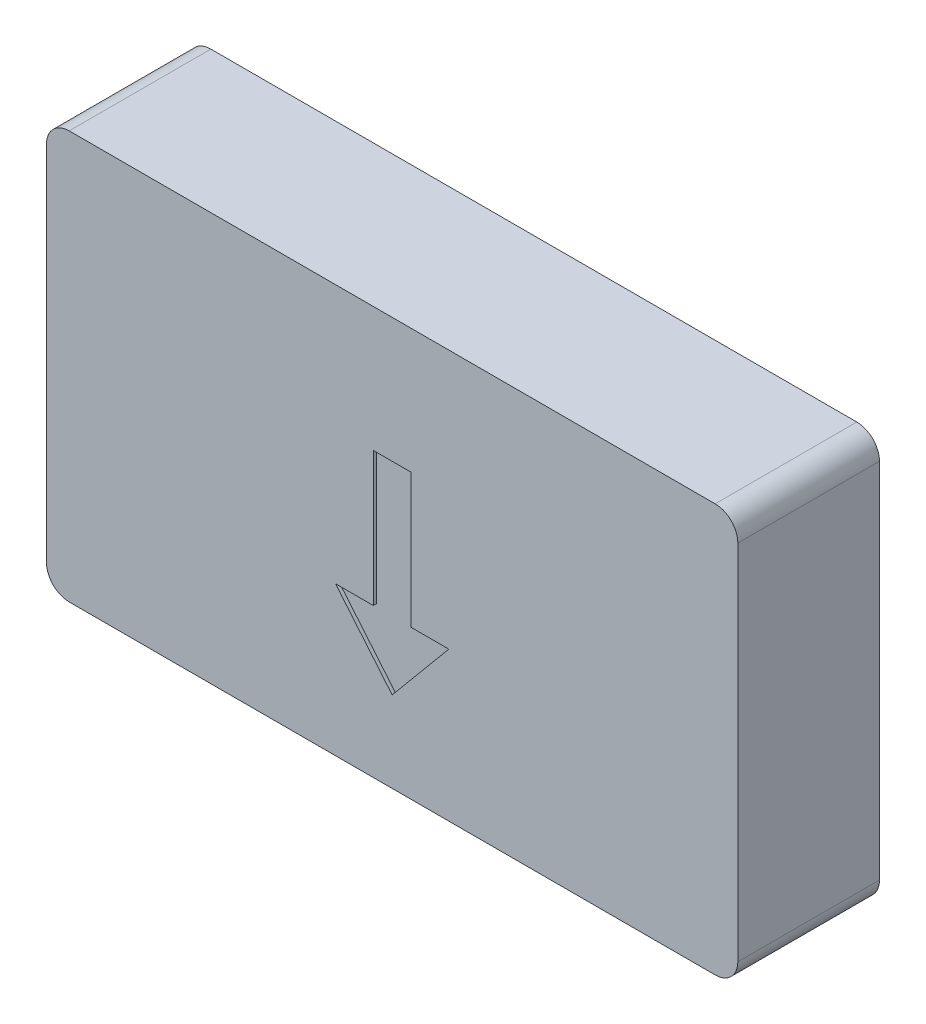
ISO-10303-21;
HEADER;
FILE_DESCRIPTION(('STEP AP214'),'2;1');
FILE_NAME('part.step','',(''),(''),'','','');
FILE_SCHEMA(('AUTOMOTIVE_DESIGN { 1 0 10303 214 1 1 1 1 }'));
ENDSEC;
DATA;
#1=APPLICATION_CONTEXT('core data for automotive mechanical design processes');
#2=APPLICATION_PROTOCOL_DEFINITION('international standard','automotive_design',2000,#1);
#3=PRODUCT_CONTEXT('',#1,'mechanical');
#4=PRODUCT('Part','Part','',(#3));
#5=PRODUCT_RELATED_PRODUCT_CATEGORY('part','',(#4));
#6=PRODUCT_DEFINITION_FORMATION('','',#4);
#7=PRODUCT_DEFINITION_CONTEXT('part definition',#1,'design');
#8=PRODUCT_DEFINITION('design','',#6,#7);
#9=PRODUCT_DEFINITION_SHAPE('','',#8);
#10=(LENGTH_UNIT() NAMED_UNIT(*) SI_UNIT(.MILLI.,.METRE.));
#11=(NAMED_UNIT(*) PLANE_ANGLE_UNIT() SI_UNIT($,.RADIAN.));
#12=(NAMED_UNIT(*) SI_UNIT($,.STERADIAN.) SOLID_ANGLE_UNIT());
#13=UNCERTAINTY_MEASURE_WITH_UNIT(LENGTH_MEASURE(1.E-05),#10,'distance_accuracy_value','');
#14=(GEOMETRIC_REPRESENTATION_CONTEXT(3) GLOBAL_UNCERTAINTY_ASSIGNED_CONTEXT((#13)) GLOBAL_UNIT_ASSIGNED_CONTEXT((#10,
#11,#12)) REPRESENTATION_CONTEXT('',''));
#15=CARTESIAN_POINT('',(0.,0.,0.));
#16=DIRECTION('',(0.,0.,1.));
#17=DIRECTION('',(1.,0.,0.));
#18=AXIS2_PLACEMENT_3D('',#15,#16,#17);
#19=CARTESIAN_POINT('',(-84.9630000000001,-104.521,1.58749999999992));
#20=DIRECTION('',(-1.,0.,0.));
#21=DIRECTION('',(0.,0.,1.));
#22=AXIS2_PLACEMENT_3D('',#19,#20,#21);
#23=PLANE('',#22);
#24=DIRECTION('',(0.,1.,0.));
#25=VECTOR('',#24,1.);
#26=CARTESIAN_POINT('',(-84.9630000000001,-104.521,1.58749999999992));
#27=LINE('',#26,#25);
#28=CARTESIAN_POINT('',(-84.9630000000001,-104.013,1.58749999999992));
#29=VERTEX_POINT('',#28);
#30=CARTESIAN_POINT('',(-84.9630000000001,-95.8849999999998,1.58749999999992));
#31=VERTEX_POINT('',#30);
#32=EDGE_CURVE('E517',#29,#31,#27,.T.);
#33=ORIENTED_EDGE('',*,*,#32,.F.);
#34=DIRECTION('',(0.,0.,-1.));
#35=VECTOR('',#34,1.);
#36=CARTESIAN_POINT('',(-84.9630000000001,-104.013,1.58749999999992));
#37=LINE('',#36,#35);
#38=CARTESIAN_POINT('',(-84.9630000000001,-104.013,-1.5875000000001));
#39=VERTEX_POINT('',#38);
#40=EDGE_CURVE('E566',#29,#39,#37,.T.);
#41=ORIENTED_EDGE('',*,*,#40,.T.);
#42=DIRECTION('',(0.,1.,0.));
#43=VECTOR('',#42,1.);
#44=CARTESIAN_POINT('',(-84.9630000000001,-104.521,-1.5875000000001));
#45=LINE('',#44,#43);
#46=CARTESIAN_POINT('',(-84.9630000000001,-95.8849999999998,-1.5875000000001));
#47=VERTEX_POINT('',#46);
#48=EDGE_CURVE('E515',#39,#47,#45,.T.);
#49=ORIENTED_EDGE('',*,*,#48,.T.);
#50=DIRECTION('',(0.,0.,-1.));
#51=VECTOR('',#50,1.);
#52=CARTESIAN_POINT('',(-84.9630000000001,-95.8849999999998,1.58749999999992));
#53=LINE('',#52,#51);
#54=EDGE_CURVE('E564',#47,#31,#53,.F.);
#55=ORIENTED_EDGE('',*,*,#54,.T.);
#56=EDGE_LOOP('',(#33,#41,#49,#55));
#57=FACE_BOUND('',#56,.T.);
#58=ADVANCED_FACE('F327',(#57),#23,.F.);
#59=CARTESIAN_POINT('',(-84.9630000000001,-95.3769999999998,1.58749999999992));
#60=DIRECTION('',(0.,-1.,0.));
#61=DIRECTION('',(0.,0.,-1.));
#62=AXIS2_PLACEMENT_3D('',#59,#60,#61);
#63=PLANE('',#62);
#64=DIRECTION('',(-1.,0.,0.));
#65=VECTOR('',#64,1.);
#66=CARTESIAN_POINT('',(-84.9630000000001,-95.3769999999998,-1.5875000000001));
#67=LINE('',#66,#65);
#68=CARTESIAN_POINT('',(-85.4710000000001,-95.3769999999998,-1.5875000000001));
#69=VERTEX_POINT('',#68);
#70=CARTESIAN_POINT('',(-99.9490000000001,-95.3769999999998,-1.58750000000012));
#71=VERTEX_POINT('',#70);
#72=EDGE_CURVE('E532',#69,#71,#67,.T.);
#73=ORIENTED_EDGE('',*,*,#72,.T.);
#74=DIRECTION('',(0.,0.,-1.));
#75=VECTOR('',#74,1.);
#76=CARTESIAN_POINT('',(-99.9490000000001,-95.3769999999998,1.58749999999989));
#77=LINE('',#76,#75);
#78=CARTESIAN_POINT('',(-99.9490000000001,-95.3769999999998,1.58749999999989));
#79=VERTEX_POINT('',#78);
#80=EDGE_CURVE('E13',#71,#79,#77,.F.);
#81=ORIENTED_EDGE('',*,*,#80,.T.);
#82=DIRECTION('',(-1.,0.,0.));
#83=VECTOR('',#82,1.);
#84=CARTESIAN_POINT('',(-84.9630000000001,-95.3769999999998,1.58749999999992));
#85=LINE('',#84,#83);
#86=CARTESIAN_POINT('',(-85.4710000000001,-95.3769999999998,1.58749999999992));
#87=VERTEX_POINT('',#86);
#88=EDGE_CURVE('E520',#87,#79,#85,.T.);
#89=ORIENTED_EDGE('',*,*,#88,.F.);
#90=DIRECTION('',(0.,0.,-1.));
#91=VECTOR('',#90,1.);
#92=CARTESIAN_POINT('',(-85.4710000000001,-95.3769999999998,1.58749999999992));
#93=LINE('',#92,#91);
#94=EDGE_CURVE('E335',#87,#69,#93,.T.);
#95=ORIENTED_EDGE('',*,*,#94,.T.);
#96=EDGE_LOOP('',(#73,#81,#89,#95));
#97=FACE_BOUND('',#96,.T.);
#98=ADVANCED_FACE('F571',(#97),#63,.F.);
#99=CARTESIAN_POINT('',(-100.457,-95.3769999999998,1.58749999999989));
#100=DIRECTION('',(1.,0.,0.));
#101=DIRECTION('',(0.,0.,-1.));
#102=AXIS2_PLACEMENT_3D('',#99,#100,#101);
#103=PLANE('',#102);
#104=DIRECTION('',(0.,-1.,0.));
#105=VECTOR('',#104,1.);
#106=CARTESIAN_POINT('',(-100.457,-95.3769999999998,-1.58750000000012));
#107=LINE('',#106,#105);
#108=CARTESIAN_POINT('',(-100.457,-95.8849999999998,-1.58750000000012));
#109=VERTEX_POINT('',#108);
#110=CARTESIAN_POINT('',(-100.457,-104.013,-1.58750000000012));
#111=VERTEX_POINT('',#110);
#112=EDGE_CURVE('E534',#109,#111,#107,.T.);
#113=ORIENTED_EDGE('',*,*,#112,.T.);
#114=DIRECTION('',(0.,0.,-1.));
#115=VECTOR('',#114,1.);
#116=CARTESIAN_POINT('',(-100.457,-104.013,1.58749999999989));
#117=LINE('',#116,#115);
#118=CARTESIAN_POINT('',(-100.457,-104.013,1.58749999999989));
#119=VERTEX_POINT('',#118);
#120=EDGE_CURVE('E554',#111,#119,#117,.F.);
#121=ORIENTED_EDGE('',*,*,#120,.T.);
#122=DIRECTION('',(0.,-1.,0.));
#123=VECTOR('',#122,1.);
#124=CARTESIAN_POINT('',(-100.457,-95.3769999999998,1.58749999999989));
#125=LINE('',#124,#123);
#126=CARTESIAN_POINT('',(-100.457,-95.8849999999998,1.58749999999989));
#127=VERTEX_POINT('',#126);
#128=EDGE_CURVE('E523',#127,#119,#125,.T.);
#129=ORIENTED_EDGE('',*,*,#128,.F.);
#130=DIRECTION('',(0.,0.,-1.));
#131=VECTOR('',#130,1.);
#132=CARTESIAN_POINT('',(-100.457,-95.8849999999998,1.58749999999989));
#133=LINE('',#132,#131);
#134=EDGE_CURVE('E551',#127,#109,#133,.T.);
#135=ORIENTED_EDGE('',*,*,#134,.T.);
#136=EDGE_LOOP('',(#113,#121,#129,#135));
#137=FACE_BOUND('',#136,.T.);
#138=ADVANCED_FACE('F585',(#137),#103,.F.);
#139=CARTESIAN_POINT('',(-100.457,-104.521,1.58749999999989));
#140=DIRECTION('',(0.,1.,0.));
#141=DIRECTION('',(0.,0.,1.));
#142=AXIS2_PLACEMENT_3D('',#139,#140,#141);
#143=PLANE('',#142);
#144=DIRECTION('',(1.,0.,0.));
#145=VECTOR('',#144,1.);
#146=CARTESIAN_POINT('',(-100.457,-104.521,1.58749999999989));
#147=LINE('',#146,#145);
#148=CARTESIAN_POINT('',(-99.9490000000001,-104.521,1.58749999999989));
#149=VERTEX_POINT('',#148);
#150=CARTESIAN_POINT('',(-85.4710000000001,-104.521,1.58749999999992));
#151=VERTEX_POINT('',#150);
#152=EDGE_CURVE('E526',#149,#151,#147,.T.);
#153=ORIENTED_EDGE('',*,*,#152,.F.);
#154=DIRECTION('',(0.,0.,-1.));
#155=VECTOR('',#154,1.);
#156=CARTESIAN_POINT('',(-99.9490000000001,-104.521,1.58749999999989));
#157=LINE('',#156,#155);
#158=CARTESIAN_POINT('',(-99.9490000000001,-104.521,-1.58750000000012));
#159=VERTEX_POINT('',#158);
#160=EDGE_CURVE('E540',#149,#159,#157,.T.);
#161=ORIENTED_EDGE('',*,*,#160,.T.);
#162=DIRECTION('',(1.,0.,0.));
#163=VECTOR('',#162,1.);
#164=CARTESIAN_POINT('',(-100.457,-104.521,-1.58750000000012));
#165=LINE('',#164,#163);
#166=CARTESIAN_POINT('',(-85.4710000000001,-104.521,-1.5875000000001));
#167=VERTEX_POINT('',#166);
#168=EDGE_CURVE('E521',#159,#167,#165,.T.);
#169=ORIENTED_EDGE('',*,*,#168,.T.);
#170=DIRECTION('',(0.,0.,-1.));
#171=VECTOR('',#170,1.);
#172=CARTESIAN_POINT('',(-85.4710000000001,-104.521,1.58749999999992));
#173=LINE('',#172,#171);
#174=EDGE_CURVE('E529',#167,#151,#173,.F.);
#175=ORIENTED_EDGE('',*,*,#174,.T.);
#176=EDGE_LOOP('',(#153,#161,#169,#175));
#177=FACE_BOUND('',#176,.T.);
#178=ADVANCED_FACE('F593',(#177),#143,.F.);
#179=CARTESIAN_POINT('',(0.,0.,1.58750000000001));
#180=DIRECTION('',(0.,0.,1.));
#181=DIRECTION('',(1.,0.,0.));
#182=AXIS2_PLACEMENT_3D('',#179,#180,#181);
#183=PLANE('',#182);
#184=DIRECTION('',(0.,-1.,0.));
#185=VECTOR('',#184,1.);
#186=CARTESIAN_POINT('',(-93.1333333333335,-101.181834933699,1.58749999999992));
#187=LINE('',#186,#185);
#188=CARTESIAN_POINT('',(-93.1333333333335,-98.1709999999998,1.58749999999991));
#189=VERTEX_POINT('',#188);
#190=CARTESIAN_POINT('',(-93.1333333333335,-101.181834933699,1.58749999999992));
#191=VERTEX_POINT('',#190);
#192=EDGE_CURVE('E473',#189,#191,#187,.T.);
#193=ORIENTED_EDGE('',*,*,#192,.F.);
#194=DIRECTION('',(-1.,0.,0.));
#195=VECTOR('',#194,1.);
#196=CARTESIAN_POINT('',(-93.1333333333335,-98.1709999999998,1.58749999999991));
#197=LINE('',#196,#195);
#198=CARTESIAN_POINT('',(-92.2866666666668,-98.1709999999998,1.58749999999992));
#199=VERTEX_POINT('',#198);
#200=EDGE_CURVE('E477',#199,#189,#197,.T.);
#201=ORIENTED_EDGE('',*,*,#200,.F.);
#202=DIRECTION('',(0.,1.,0.));
#203=VECTOR('',#202,1.);
#204=CARTESIAN_POINT('',(-92.2866666666668,-101.181834933699,1.58749999999992));
#205=LINE('',#204,#203);
#206=CARTESIAN_POINT('',(-92.2866666666668,-101.181834933699,1.58749999999992));
#207=VERTEX_POINT('',#206);
#208=EDGE_CURVE('E342',#207,#199,#205,.T.);
#209=ORIENTED_EDGE('',*,*,#208,.F.);
#210=DIRECTION('',(-1.,0.,0.));
#211=VECTOR('',#210,1.);
#212=CARTESIAN_POINT('',(-91.4400000000001,-101.181834933699,1.58749999999992));
#213=LINE('',#212,#211);
#214=CARTESIAN_POINT('',(-91.4400000000001,-101.181834933699,1.58749999999992));
#215=VERTEX_POINT('',#214);
#216=EDGE_CURVE('E438',#215,#207,#213,.T.);
#217=ORIENTED_EDGE('',*,*,#216,.F.);
#218=DIRECTION('',(0.640184399664475,0.768221279597383,0.));
#219=VECTOR('',#218,1.);
#220=CARTESIAN_POINT('',(-92.7100000000001,-102.705834933699,1.58749999999992));
#221=LINE('',#220,#219);
#222=CARTESIAN_POINT('',(-92.7100000000001,-102.705834933699,1.58749999999992));
#223=VERTEX_POINT('',#222);
#224=EDGE_CURVE('E448',#223,#215,#221,.T.);
#225=ORIENTED_EDGE('',*,*,#224,.F.);
#226=DIRECTION('',(0.640184399664475,-0.768221279597383,0.));
#227=VECTOR('',#226,1.);
#228=CARTESIAN_POINT('',(-92.7100000000001,-102.705834933699,1.58749999999992));
#229=LINE('',#228,#227);
#230=CARTESIAN_POINT('',(-93.9800000000001,-101.181834933699,1.58749999999992));
#231=VERTEX_POINT('',#230);
#232=EDGE_CURVE('E454',#231,#223,#229,.T.);
#233=ORIENTED_EDGE('',*,*,#232,.F.);
#234=DIRECTION('',(-1.,0.,0.));
#235=VECTOR('',#234,1.);
#236=CARTESIAN_POINT('',(-93.1333333333335,-101.181834933699,1.58749999999992));
#237=LINE('',#236,#235);
#238=EDGE_CURVE('E469',#191,#231,#237,.T.);
#239=ORIENTED_EDGE('',*,*,#238,.F.);
#240=EDGE_LOOP('',(#193,#201,#209,#217,#225,#233,#239));
#241=FACE_BOUND('',#240,.T.);
#242=ORIENTED_EDGE('',*,*,#128,.T.);
#243=CARTESIAN_POINT('',(-99.9490000000001,-104.013,1.58749999999989));
#244=DIRECTION('',(0.,0.,1.));
#245=DIRECTION('',(1.,0.,0.));
#246=AXIS2_PLACEMENT_3D('',#243,#244,#245);
#247=CIRCLE('',#246,0.508);
#248=EDGE_CURVE('E562',#119,#149,#247,.T.);
#249=ORIENTED_EDGE('',*,*,#248,.T.);
#250=ORIENTED_EDGE('',*,*,#152,.T.);
#251=CARTESIAN_POINT('',(-85.4710000000001,-104.013,1.58749999999992));
#252=DIRECTION('',(0.,0.,1.));
#253=DIRECTION('',(1.,0.,0.));
#254=AXIS2_PLACEMENT_3D('',#251,#252,#253);
#255=CIRCLE('',#254,0.508);
#256=EDGE_CURVE('E560',#151,#29,#255,.T.);
#257=ORIENTED_EDGE('',*,*,#256,.T.);
#258=ORIENTED_EDGE('',*,*,#32,.T.);
#259=CARTESIAN_POINT('',(-85.4710000000001,-95.8849999999998,1.58749999999992));
#260=DIRECTION('',(0.,0.,1.));
#261=DIRECTION('',(1.,0.,0.));
#262=AXIS2_PLACEMENT_3D('',#259,#260,#261);
#263=CIRCLE('',#262,0.508);
#264=EDGE_CURVE('E556',#31,#87,#263,.T.);
#265=ORIENTED_EDGE('',*,*,#264,.T.);
#266=ORIENTED_EDGE('',*,*,#88,.T.);
#267=CARTESIAN_POINT('',(-99.9490000000001,-95.8849999999998,1.58749999999989));
#268=DIRECTION('',(0.,0.,1.));
#269=DIRECTION('',(1.,0.,0.));
#270=AXIS2_PLACEMENT_3D('',#267,#268,#269);
#271=CIRCLE('',#270,0.508);
#272=EDGE_CURVE('E558',#79,#127,#271,.T.);
#273=ORIENTED_EDGE('',*,*,#272,.T.);
#274=EDGE_LOOP('',(#242,#249,#250,#257,#258,#265,#266,#273));
#275=FACE_BOUND('',#274,.T.);
#276=ADVANCED_FACE('F457',(#241,#275),#183,.T.);
#277=CARTESIAN_POINT('',(0.,0.,-1.58750000000002));
#278=DIRECTION('',(0.,0.,1.));
#279=DIRECTION('',(1.,0.,0.));
#280=AXIS2_PLACEMENT_3D('',#277,#278,#279);
#281=PLANE('',#280);
#282=ORIENTED_EDGE('',*,*,#168,.F.);
#283=CARTESIAN_POINT('',(-99.9490000000001,-104.013,-1.58750000000012));
#284=DIRECTION('',(0.,0.,1.));
#285=DIRECTION('',(1.,0.,0.));
#286=AXIS2_PLACEMENT_3D('',#283,#284,#285);
#287=CIRCLE('',#286,0.508);
#288=EDGE_CURVE('E549',#159,#111,#287,.F.);
#289=ORIENTED_EDGE('',*,*,#288,.T.);
#290=ORIENTED_EDGE('',*,*,#112,.F.);
#291=CARTESIAN_POINT('',(-99.9490000000001,-95.8849999999998,-1.58750000000012));
#292=DIRECTION('',(0.,0.,1.));
#293=DIRECTION('',(1.,0.,0.));
#294=AXIS2_PLACEMENT_3D('',#291,#292,#293);
#295=CIRCLE('',#294,0.508);
#296=EDGE_CURVE('E545',#109,#71,#295,.F.);
#297=ORIENTED_EDGE('',*,*,#296,.T.);
#298=ORIENTED_EDGE('',*,*,#72,.F.);
#299=CARTESIAN_POINT('',(-85.4710000000001,-95.8849999999998,-1.5875000000001));
#300=DIRECTION('',(0.,0.,1.));
#301=DIRECTION('',(1.,0.,0.));
#302=AXIS2_PLACEMENT_3D('',#299,#300,#301);
#303=CIRCLE('',#302,0.508);
#304=EDGE_CURVE('E543',#69,#47,#303,.F.);
#305=ORIENTED_EDGE('',*,*,#304,.T.);
#306=ORIENTED_EDGE('',*,*,#48,.F.);
#307=CARTESIAN_POINT('',(-85.4710000000001,-104.013,-1.5875000000001));
#308=DIRECTION('',(0.,0.,1.));
#309=DIRECTION('',(1.,0.,0.));
#310=AXIS2_PLACEMENT_3D('',#307,#308,#309);
#311=CIRCLE('',#310,0.508);
#312=EDGE_CURVE('E547',#39,#167,#311,.F.);
#313=ORIENTED_EDGE('',*,*,#312,.T.);
#314=EDGE_LOOP('',(#282,#289,#290,#297,#298,#305,#306,#313));
#315=FACE_BOUND('',#314,.T.);
#316=ADVANCED_FACE('F576',(#315),#281,.F.);
#317=CARTESIAN_POINT('',(-99.9490000000001,-104.013,1.58749999999989));
#318=DIRECTION('',(0.,0.,-1.));
#319=DIRECTION('',(-1.,0.,0.));
#320=AXIS2_PLACEMENT_3D('',#317,#318,#319);
#321=CYLINDRICAL_SURFACE('',#320,0.508);
#322=ORIENTED_EDGE('',*,*,#248,.F.);
#323=ORIENTED_EDGE('',*,*,#120,.F.);
#324=ORIENTED_EDGE('',*,*,#288,.F.);
#325=ORIENTED_EDGE('',*,*,#160,.F.);
#326=EDGE_LOOP('',(#322,#323,#324,#325));
#327=FACE_BOUND('',#326,.T.);
#328=ADVANCED_FACE('F591',(#327),#321,.T.);
#329=CARTESIAN_POINT('',(-85.4710000000001,-104.013,1.58749999999992));
#330=DIRECTION('',(0.,0.,-1.));
#331=DIRECTION('',(-1.,0.,0.));
#332=AXIS2_PLACEMENT_3D('',#329,#330,#331);
#333=CYLINDRICAL_SURFACE('',#332,0.508);
#334=ORIENTED_EDGE('',*,*,#256,.F.);
#335=ORIENTED_EDGE('',*,*,#174,.F.);
#336=ORIENTED_EDGE('',*,*,#312,.F.);
#337=ORIENTED_EDGE('',*,*,#40,.F.);
#338=EDGE_LOOP('',(#334,#335,#336,#337));
#339=FACE_BOUND('',#338,.T.);
#340=ADVANCED_FACE('F598',(#339),#333,.T.);
#341=CARTESIAN_POINT('',(-99.9490000000001,-95.8849999999998,1.58749999999989));
#342=DIRECTION('',(0.,0.,-1.));
#343=DIRECTION('',(-1.,0.,0.));
#344=AXIS2_PLACEMENT_3D('',#341,#342,#343);
#345=CYLINDRICAL_SURFACE('',#344,0.508);
#346=ORIENTED_EDGE('',*,*,#272,.F.);
#347=ORIENTED_EDGE('',*,*,#80,.F.);
#348=ORIENTED_EDGE('',*,*,#296,.F.);
#349=ORIENTED_EDGE('',*,*,#134,.F.);
#350=EDGE_LOOP('',(#346,#347,#348,#349));
#351=FACE_BOUND('',#350,.T.);
#352=ADVANCED_FACE('F582',(#351),#345,.T.);
#353=CARTESIAN_POINT('',(-85.4710000000001,-95.8849999999998,1.58749999999992));
#354=DIRECTION('',(0.,0.,-1.));
#355=DIRECTION('',(-1.,0.,0.));
#356=AXIS2_PLACEMENT_3D('',#353,#354,#355);
#357=CYLINDRICAL_SURFACE('',#356,0.508);
#358=ORIENTED_EDGE('',*,*,#264,.F.);
#359=ORIENTED_EDGE('',*,*,#54,.F.);
#360=ORIENTED_EDGE('',*,*,#304,.F.);
#361=ORIENTED_EDGE('',*,*,#94,.F.);
#362=EDGE_LOOP('',(#358,#359,#360,#361));
#363=FACE_BOUND('',#362,.T.);
#364=ADVANCED_FACE('F329',(#363),#357,.T.);
#365=CARTESIAN_POINT('',(-93.1333333333335,-101.181834933699,1.58749999999992));
#366=DIRECTION('',(-1.,0.,0.));
#367=DIRECTION('',(0.,-1.,0.));
#368=AXIS2_PLACEMENT_3D('',#365,#366,#367);
#369=PLANE('',#368);
#370=DIRECTION('',(0.,0.,1.));
#371=VECTOR('',#370,1.);
#372=CARTESIAN_POINT('',(-93.1333333333335,-98.1709999999998,1.58749999999991));
#373=LINE('',#372,#371);
#374=CARTESIAN_POINT('',(-93.1333333333335,-98.1709999999998,1.51129999999991));
#375=VERTEX_POINT('',#374);
#376=EDGE_CURVE('E514',#375,#189,#373,.T.);
#377=ORIENTED_EDGE('',*,*,#376,.T.);
#378=ORIENTED_EDGE('',*,*,#192,.T.);
#379=DIRECTION('',(0.,0.,1.));
#380=VECTOR('',#379,1.);
#381=CARTESIAN_POINT('',(-93.1333333333335,-101.181834933699,1.58749999999992));
#382=LINE('',#381,#380);
#383=CARTESIAN_POINT('',(-93.1333333333335,-101.181834933699,1.51129999999992));
#384=VERTEX_POINT('',#383);
#385=EDGE_CURVE('E512',#384,#191,#382,.T.);
#386=ORIENTED_EDGE('',*,*,#385,.F.);
#387=DIRECTION('',(0.,1.,0.));
#388=VECTOR('',#387,1.);
#389=CARTESIAN_POINT('',(-93.1333333333335,0.,1.51129999999991));
#390=LINE('',#389,#388);
#391=EDGE_CURVE('E501',#375,#384,#390,.F.);
#392=ORIENTED_EDGE('',*,*,#391,.F.);
#393=EDGE_LOOP('',(#377,#378,#386,#392));
#394=FACE_BOUND('',#393,.T.);
#395=ADVANCED_FACE('F603',(#394),#369,.F.);
#396=CARTESIAN_POINT('',(-93.1333333333335,-101.181834933699,1.58749999999992));
#397=DIRECTION('',(0.,1.,0.));
#398=DIRECTION('',(-1.,0.,0.));
#399=AXIS2_PLACEMENT_3D('',#396,#397,#398);
#400=PLANE('',#399);
#401=ORIENTED_EDGE('',*,*,#385,.T.);
#402=ORIENTED_EDGE('',*,*,#238,.T.);
#403=DIRECTION('',(0.,0.,1.));
#404=VECTOR('',#403,1.);
#405=CARTESIAN_POINT('',(-93.9800000000001,-101.181834933699,1.58749999999992));
#406=LINE('',#405,#404);
#407=CARTESIAN_POINT('',(-93.9800000000001,-101.181834933699,1.51129999999991));
#408=VERTEX_POINT('',#407);
#409=EDGE_CURVE('E510',#408,#231,#406,.T.);
#410=ORIENTED_EDGE('',*,*,#409,.F.);
#411=DIRECTION('',(1.,0.,0.));
#412=VECTOR('',#411,1.);
#413=CARTESIAN_POINT('',(0.,-101.181834933699,1.51129999999999));
#414=LINE('',#413,#412);
#415=EDGE_CURVE('E497',#384,#408,#414,.F.);
#416=ORIENTED_EDGE('',*,*,#415,.F.);
#417=EDGE_LOOP('',(#401,#402,#410,#416));
#418=FACE_BOUND('',#417,.T.);
#419=ADVANCED_FACE('F608',(#418),#400,.F.);
#420=CARTESIAN_POINT('',(-92.7100000000001,-102.705834933699,1.58749999999992));
#421=DIRECTION('',(-0.76822127959738,-0.640184399664477,0.));
#422=DIRECTION('',(0.640184399664475,-0.768221279597383,0.));
#423=AXIS2_PLACEMENT_3D('',#420,#421,#422);
#424=PLANE('',#423);
#425=ORIENTED_EDGE('',*,*,#409,.T.);
#426=ORIENTED_EDGE('',*,*,#232,.T.);
#427=DIRECTION('',(0.,0.,1.));
#428=VECTOR('',#427,1.);
#429=CARTESIAN_POINT('',(-92.7100000000001,-102.705834933699,1.58749999999992));
#430=LINE('',#429,#428);
#431=CARTESIAN_POINT('',(-92.7100000000001,-102.705834933699,1.51129999999992));
#432=VERTEX_POINT('',#431);
#433=EDGE_CURVE('E444',#432,#223,#430,.T.);
#434=ORIENTED_EDGE('',*,*,#433,.F.);
#435=DIRECTION('',(0.640184399664475,-0.768221279597383,0.));
#436=VECTOR('',#435,1.);
#437=CARTESIAN_POINT('',(-92.7100000000001,-102.705834933699,1.51129999999992));
#438=LINE('',#437,#436);
#439=EDGE_CURVE('E493',#408,#432,#438,.T.);
#440=ORIENTED_EDGE('',*,*,#439,.F.);
#441=EDGE_LOOP('',(#425,#426,#434,#440));
#442=FACE_BOUND('',#441,.T.);
#443=ADVANCED_FACE('F650',(#442),#424,.F.);
#444=CARTESIAN_POINT('',(-92.7100000000001,-102.705834933699,1.58749999999992));
#445=DIRECTION('',(0.76822127959738,-0.640184399664477,0.));
#446=DIRECTION('',(0.640184399664475,0.768221279597383,0.));
#447=AXIS2_PLACEMENT_3D('',#444,#445,#446);
#448=PLANE('',#447);
#449=ORIENTED_EDGE('',*,*,#433,.T.);
#450=ORIENTED_EDGE('',*,*,#224,.T.);
#451=DIRECTION('',(0.,0.,1.));
#452=VECTOR('',#451,1.);
#453=CARTESIAN_POINT('',(-91.4400000000001,-101.181834933699,1.58749999999992));
#454=LINE('',#453,#452);
#455=CARTESIAN_POINT('',(-91.4400000000001,-101.181834933699,1.51129999999992));
#456=VERTEX_POINT('',#455);
#457=EDGE_CURVE('E434',#456,#215,#454,.T.);
#458=ORIENTED_EDGE('',*,*,#457,.F.);
#459=DIRECTION('',(0.640184399664475,0.768221279597383,0.));
#460=VECTOR('',#459,1.);
#461=CARTESIAN_POINT('',(-92.7100000000001,-102.705834933699,1.51129999999992));
#462=LINE('',#461,#460);
#463=EDGE_CURVE('E490',#432,#456,#462,.T.);
#464=ORIENTED_EDGE('',*,*,#463,.F.);
#465=EDGE_LOOP('',(#449,#450,#458,#464));
#466=FACE_BOUND('',#465,.T.);
#467=ADVANCED_FACE('F449',(#466),#448,.F.);
#468=CARTESIAN_POINT('',(-91.4400000000001,-101.181834933699,1.58749999999992));
#469=DIRECTION('',(0.,1.,0.));
#470=DIRECTION('',(-1.,0.,0.));
#471=AXIS2_PLACEMENT_3D('',#468,#469,#470);
#472=PLANE('',#471);
#473=ORIENTED_EDGE('',*,*,#457,.T.);
#474=ORIENTED_EDGE('',*,*,#216,.T.);
#475=DIRECTION('',(0.,0.,1.));
#476=VECTOR('',#475,1.);
#477=CARTESIAN_POINT('',(-92.2866666666668,-101.181834933699,1.58749999999992));
#478=LINE('',#477,#476);
#479=CARTESIAN_POINT('',(-92.2866666666668,-101.181834933699,1.51129999999992));
#480=VERTEX_POINT('',#479);
#481=EDGE_CURVE('E445',#480,#207,#478,.T.);
#482=ORIENTED_EDGE('',*,*,#481,.F.);
#483=DIRECTION('',(1.,0.,0.));
#484=VECTOR('',#483,1.);
#485=CARTESIAN_POINT('',(0.,-101.181834933699,1.51129999999999));
#486=LINE('',#485,#484);
#487=EDGE_CURVE('E440',#456,#480,#486,.F.);
#488=ORIENTED_EDGE('',*,*,#487,.F.);
#489=EDGE_LOOP('',(#473,#474,#482,#488));
#490=FACE_BOUND('',#489,.T.);
#491=ADVANCED_FACE('F436',(#490),#472,.F.);
#492=CARTESIAN_POINT('',(-92.2866666666668,-101.181834933699,1.58749999999992));
#493=DIRECTION('',(1.,0.,0.));
#494=DIRECTION('',(0.,1.,0.));
#495=AXIS2_PLACEMENT_3D('',#492,#493,#494);
#496=PLANE('',#495);
#497=ORIENTED_EDGE('',*,*,#481,.T.);
#498=ORIENTED_EDGE('',*,*,#208,.T.);
#499=DIRECTION('',(0.,0.,1.));
#500=VECTOR('',#499,1.);
#501=CARTESIAN_POINT('',(-92.2866666666668,-98.1709999999998,1.58749999999992));
#502=LINE('',#501,#500);
#503=CARTESIAN_POINT('',(-92.2866666666668,-98.1709999999998,1.51129999999992));
#504=VERTEX_POINT('',#503);
#505=EDGE_CURVE('E461',#504,#199,#502,.T.);
#506=ORIENTED_EDGE('',*,*,#505,.F.);
#507=DIRECTION('',(0.,1.,0.));
#508=VECTOR('',#507,1.);
#509=CARTESIAN_POINT('',(-92.2866666666668,0.,1.51129999999992));
#510=LINE('',#509,#508);
#511=EDGE_CURVE('E483',#480,#504,#510,.T.);
#512=ORIENTED_EDGE('',*,*,#511,.F.);
#513=EDGE_LOOP('',(#497,#498,#506,#512));
#514=FACE_BOUND('',#513,.T.);
#515=ADVANCED_FACE('F677',(#514),#496,.F.);
#516=CARTESIAN_POINT('',(-93.1333333333335,-98.1709999999998,1.58749999999991));
#517=DIRECTION('',(0.,1.,0.));
#518=DIRECTION('',(-1.,0.,0.));
#519=AXIS2_PLACEMENT_3D('',#516,#517,#518);
#520=PLANE('',#519);
#521=DIRECTION('',(1.,0.,0.));
#522=VECTOR('',#521,1.);
#523=CARTESIAN_POINT('',(0.,-98.1709999999998,1.51129999999999));
#524=LINE('',#523,#522);
#525=EDGE_CURVE('E487',#504,#375,#524,.F.);
#526=ORIENTED_EDGE('',*,*,#525,.F.);
#527=ORIENTED_EDGE('',*,*,#505,.T.);
#528=ORIENTED_EDGE('',*,*,#200,.T.);
#529=ORIENTED_EDGE('',*,*,#376,.F.);
#530=EDGE_LOOP('',(#526,#527,#528,#529));
#531=FACE_BOUND('',#530,.T.);
#532=ADVANCED_FACE('F686',(#531),#520,.F.);
#533=CARTESIAN_POINT('',(0.,0.,1.51130000000001));
#534=DIRECTION('',(0.,0.,1.));
#535=DIRECTION('',(1.,0.,0.));
#536=AXIS2_PLACEMENT_3D('',#533,#534,#535);
#537=PLANE('',#536);
#538=ORIENTED_EDGE('',*,*,#511,.T.);
#539=ORIENTED_EDGE('',*,*,#525,.T.);
#540=ORIENTED_EDGE('',*,*,#391,.T.);
#541=ORIENTED_EDGE('',*,*,#415,.T.);
#542=ORIENTED_EDGE('',*,*,#439,.T.);
#543=ORIENTED_EDGE('',*,*,#463,.T.);
#544=ORIENTED_EDGE('',*,*,#487,.T.);
#545=EDGE_LOOP('',(#538,#539,#540,#541,#542,#543,#544));
#546=FACE_BOUND('',#545,.T.);
#547=ADVANCED_FACE('F695',(#546),#537,.T.);
#548=CLOSED_SHELL('',(#58,#98,#138,#178,#276,#316,#328,#340,#352,#364,#395,#419,#443,#467,#491,
#515,#532,#547));
#549=MANIFOLD_SOLID_BREP('B2',#548);
#550=ADVANCED_BREP_SHAPE_REPRESENTATION('',(#18,#549),#14);
#551=SHAPE_DEFINITION_REPRESENTATION(#9,#550);
ENDSEC;
END-ISO-10303-21;
